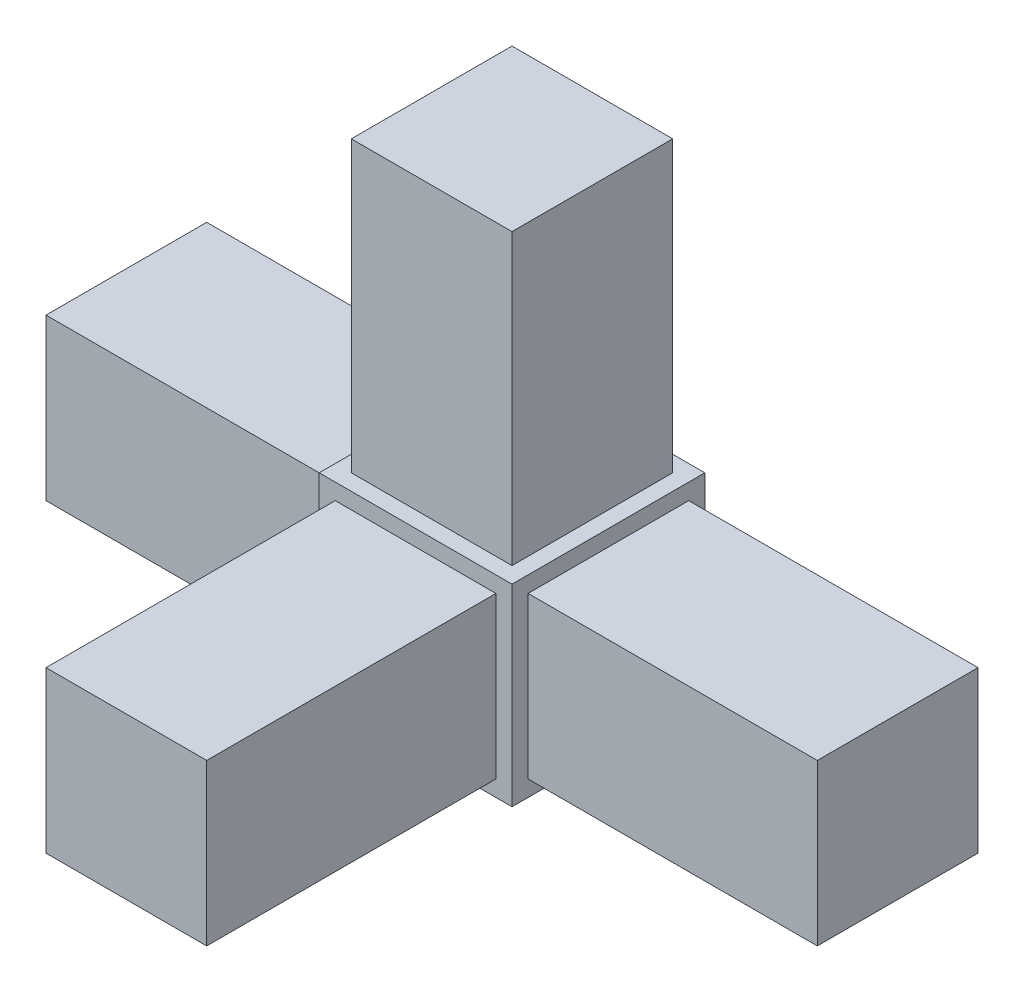
ISO-10303-21;
HEADER;
FILE_DESCRIPTION(('STEP AP214'),'2;1');
FILE_NAME('part.step','',(''),(''),'','','');
FILE_SCHEMA(('AUTOMOTIVE_DESIGN { 1 0 10303 214 1 1 1 1 }'));
ENDSEC;
DATA;
#1=APPLICATION_CONTEXT('core data for automotive mechanical design processes');
#2=APPLICATION_PROTOCOL_DEFINITION('international standard','automotive_design',2000,#1);
#3=PRODUCT_CONTEXT('',#1,'mechanical');
#4=PRODUCT('Part','Part','',(#3));
#5=PRODUCT_RELATED_PRODUCT_CATEGORY('part','',(#4));
#6=PRODUCT_DEFINITION_FORMATION('','',#4);
#7=PRODUCT_DEFINITION_CONTEXT('part definition',#1,'design');
#8=PRODUCT_DEFINITION('design','',#6,#7);
#9=PRODUCT_DEFINITION_SHAPE('','',#8);
#10=(LENGTH_UNIT() NAMED_UNIT(*) SI_UNIT(.MILLI.,.METRE.));
#11=(NAMED_UNIT(*) PLANE_ANGLE_UNIT() SI_UNIT($,.RADIAN.));
#12=(NAMED_UNIT(*) SI_UNIT($,.STERADIAN.) SOLID_ANGLE_UNIT());
#13=UNCERTAINTY_MEASURE_WITH_UNIT(LENGTH_MEASURE(1.E-05),#10,'distance_accuracy_value','');
#14=(GEOMETRIC_REPRESENTATION_CONTEXT(3) GLOBAL_UNCERTAINTY_ASSIGNED_CONTEXT((#13)) GLOBAL_UNIT_ASSIGNED_CONTEXT((#10,
#11,#12)) REPRESENTATION_CONTEXT('',''));
#15=CARTESIAN_POINT('',(0.,0.,0.));
#16=DIRECTION('',(0.,0.,1.));
#17=DIRECTION('',(1.,0.,0.));
#18=AXIS2_PLACEMENT_3D('',#15,#16,#17);
#19=CARTESIAN_POINT('',(-9.525,-9.525,19.05));
#20=DIRECTION('',(1.,0.,0.));
#21=DIRECTION('',(0.,0.,-1.));
#22=AXIS2_PLACEMENT_3D('',#19,#20,#21);
#23=PLANE('',#22);
#24=DIRECTION('',(0.,-1.,0.));
#25=VECTOR('',#24,1.);
#26=CARTESIAN_POINT('',(-9.525,-9.525,0.));
#27=LINE('',#26,#25);
#28=CARTESIAN_POINT('',(-9.525,9.525,0.));
#29=VERTEX_POINT('',#28);
#30=CARTESIAN_POINT('',(-9.525,-9.525,0.));
#31=VERTEX_POINT('',#30);
#32=EDGE_CURVE('E289',#29,#31,#27,.T.);
#33=ORIENTED_EDGE('',*,*,#32,.T.);
#34=DIRECTION('',(0.,0.,-1.));
#35=VECTOR('',#34,1.);
#36=CARTESIAN_POINT('',(-9.525,-9.525,19.05));
#37=LINE('',#36,#35);
#38=CARTESIAN_POINT('',(-9.525,-9.525,19.05));
#39=VERTEX_POINT('',#38);
#40=EDGE_CURVE('E11',#39,#31,#37,.T.);
#41=ORIENTED_EDGE('',*,*,#40,.F.);
#42=DIRECTION('',(0.,-1.,0.));
#43=VECTOR('',#42,1.);
#44=CARTESIAN_POINT('',(-9.525,-9.525,19.05));
#45=LINE('',#44,#43);
#46=CARTESIAN_POINT('',(-9.525,9.525,19.05));
#47=VERTEX_POINT('',#46);
#48=EDGE_CURVE('E290',#47,#39,#45,.T.);
#49=ORIENTED_EDGE('',*,*,#48,.F.);
#50=DIRECTION('',(0.,0.,-1.));
#51=VECTOR('',#50,1.);
#52=CARTESIAN_POINT('',(-9.525,9.525,19.05));
#53=LINE('',#52,#51);
#54=EDGE_CURVE('E300',#47,#29,#53,.T.);
#55=ORIENTED_EDGE('',*,*,#54,.T.);
#56=EDGE_LOOP('',(#33,#41,#49,#55));
#57=FACE_BOUND('',#56,.T.);
#58=DIRECTION('',(0.,-1.,0.));
#59=VECTOR('',#58,1.);
#60=CARTESIAN_POINT('',(-9.525,7.9375,1.5875));
#61=LINE('',#60,#59);
#62=CARTESIAN_POINT('',(-9.525,7.9375,1.5875));
#63=VERTEX_POINT('',#62);
#64=CARTESIAN_POINT('',(-9.525,-7.9375,1.58750000000001));
#65=VERTEX_POINT('',#64);
#66=EDGE_CURVE('E188',#63,#65,#61,.T.);
#67=ORIENTED_EDGE('',*,*,#66,.F.);
#68=DIRECTION('',(0.,0.,-1.));
#69=VECTOR('',#68,1.);
#70=CARTESIAN_POINT('',(-9.525,7.9375,1.5875));
#71=LINE('',#70,#69);
#72=CARTESIAN_POINT('',(-9.525,7.9375,17.4625));
#73=VERTEX_POINT('',#72);
#74=EDGE_CURVE('E185',#73,#63,#71,.T.);
#75=ORIENTED_EDGE('',*,*,#74,.F.);
#76=DIRECTION('',(0.,1.,0.));
#77=VECTOR('',#76,1.);
#78=CARTESIAN_POINT('',(-9.525,7.9375,17.4625));
#79=LINE('',#78,#77);
#80=CARTESIAN_POINT('',(-9.525,-7.9375,17.4625));
#81=VERTEX_POINT('',#80);
#82=EDGE_CURVE('E51',#81,#73,#79,.T.);
#83=ORIENTED_EDGE('',*,*,#82,.F.);
#84=DIRECTION('',(0.,0.,1.));
#85=VECTOR('',#84,1.);
#86=CARTESIAN_POINT('',(-9.525,-7.9375,1.58750000000001));
#87=LINE('',#86,#85);
#88=EDGE_CURVE('E46',#65,#81,#87,.T.);
#89=ORIENTED_EDGE('',*,*,#88,.F.);
#90=EDGE_LOOP('',(#67,#75,#83,#89));
#91=FACE_BOUND('',#90,.T.);
#92=ADVANCED_FACE('F32',(#57,#91),#23,.F.);
#93=CARTESIAN_POINT('',(0.,0.,19.05));
#94=DIRECTION('',(0.,0.,1.));
#95=DIRECTION('',(1.,0.,0.));
#96=AXIS2_PLACEMENT_3D('',#93,#94,#95);
#97=PLANE('',#96);
#98=ORIENTED_EDGE('',*,*,#48,.T.);
#99=DIRECTION('',(1.,0.,0.));
#100=VECTOR('',#99,1.);
#101=CARTESIAN_POINT('',(9.525,-9.525,19.05));
#102=LINE('',#101,#100);
#103=CARTESIAN_POINT('',(9.525,-9.525,19.05));
#104=VERTEX_POINT('',#103);
#105=EDGE_CURVE('E293',#39,#104,#102,.T.);
#106=ORIENTED_EDGE('',*,*,#105,.T.);
#107=DIRECTION('',(0.,1.,0.));
#108=VECTOR('',#107,1.);
#109=CARTESIAN_POINT('',(9.525,-9.525,19.05));
#110=LINE('',#109,#108);
#111=CARTESIAN_POINT('',(9.525,9.525,19.05));
#112=VERTEX_POINT('',#111);
#113=EDGE_CURVE('E296',#104,#112,#110,.T.);
#114=ORIENTED_EDGE('',*,*,#113,.T.);
#115=DIRECTION('',(-1.,0.,0.));
#116=VECTOR('',#115,1.);
#117=CARTESIAN_POINT('',(9.525,9.525,19.05));
#118=LINE('',#117,#116);
#119=EDGE_CURVE('E298',#112,#47,#118,.T.);
#120=ORIENTED_EDGE('',*,*,#119,.T.);
#121=EDGE_LOOP('',(#98,#106,#114,#120));
#122=FACE_BOUND('',#121,.T.);
#123=DIRECTION('',(1.,0.,0.));
#124=VECTOR('',#123,1.);
#125=CARTESIAN_POINT('',(7.9375,-7.9375,19.05));
#126=LINE('',#125,#124);
#127=CARTESIAN_POINT('',(-7.9375,-7.9375,19.05));
#128=VERTEX_POINT('',#127);
#129=CARTESIAN_POINT('',(7.9375,-7.9375,19.05));
#130=VERTEX_POINT('',#129);
#131=EDGE_CURVE('E192',#128,#130,#126,.T.);
#132=ORIENTED_EDGE('',*,*,#131,.F.);
#133=DIRECTION('',(0.,-1.,0.));
#134=VECTOR('',#133,1.);
#135=CARTESIAN_POINT('',(-7.9375,-7.9375,19.05));
#136=LINE('',#135,#134);
#137=CARTESIAN_POINT('',(-7.9375,7.9375,19.05));
#138=VERTEX_POINT('',#137);
#139=EDGE_CURVE('E189',#138,#128,#136,.T.);
#140=ORIENTED_EDGE('',*,*,#139,.F.);
#141=DIRECTION('',(-1.,0.,0.));
#142=VECTOR('',#141,1.);
#143=CARTESIAN_POINT('',(7.9375,7.9375,19.05));
#144=LINE('',#143,#142);
#145=CARTESIAN_POINT('',(7.9375,7.9375,19.05));
#146=VERTEX_POINT('',#145);
#147=EDGE_CURVE('E202',#146,#138,#144,.T.);
#148=ORIENTED_EDGE('',*,*,#147,.F.);
#149=DIRECTION('',(0.,1.,0.));
#150=VECTOR('',#149,1.);
#151=CARTESIAN_POINT('',(7.9375,-7.9375,19.05));
#152=LINE('',#151,#150);
#153=EDGE_CURVE('E210',#130,#146,#152,.T.);
#154=ORIENTED_EDGE('',*,*,#153,.F.);
#155=EDGE_LOOP('',(#132,#140,#148,#154));
#156=FACE_BOUND('',#155,.T.);
#157=ADVANCED_FACE('F334',(#122,#156),#97,.T.);
#158=CARTESIAN_POINT('',(9.525,-9.525,19.05));
#159=DIRECTION('',(-1.,0.,0.));
#160=DIRECTION('',(0.,0.,1.));
#161=AXIS2_PLACEMENT_3D('',#158,#159,#160);
#162=PLANE('',#161);
#163=DIRECTION('',(0.,1.,0.));
#164=VECTOR('',#163,1.);
#165=CARTESIAN_POINT('',(9.525,-9.525,0.));
#166=LINE('',#165,#164);
#167=CARTESIAN_POINT('',(9.525,-9.525,0.));
#168=VERTEX_POINT('',#167);
#169=CARTESIAN_POINT('',(9.525,9.525,0.));
#170=VERTEX_POINT('',#169);
#171=EDGE_CURVE('E305',#168,#170,#166,.T.);
#172=ORIENTED_EDGE('',*,*,#171,.T.);
#173=DIRECTION('',(0.,0.,-1.));
#174=VECTOR('',#173,1.);
#175=CARTESIAN_POINT('',(9.525,9.525,19.05));
#176=LINE('',#175,#174);
#177=EDGE_CURVE('E310',#112,#170,#176,.T.);
#178=ORIENTED_EDGE('',*,*,#177,.F.);
#179=ORIENTED_EDGE('',*,*,#113,.F.);
#180=DIRECTION('',(0.,0.,-1.));
#181=VECTOR('',#180,1.);
#182=CARTESIAN_POINT('',(9.525,-9.525,19.05));
#183=LINE('',#182,#181);
#184=EDGE_CURVE('E39',#104,#168,#183,.T.);
#185=ORIENTED_EDGE('',*,*,#184,.T.);
#186=EDGE_LOOP('',(#172,#178,#179,#185));
#187=FACE_BOUND('',#186,.T.);
#188=DIRECTION('',(0.,1.,0.));
#189=VECTOR('',#188,1.);
#190=CARTESIAN_POINT('',(9.525,-7.9375,1.5875));
#191=LINE('',#190,#189);
#192=CARTESIAN_POINT('',(9.525,-7.9375,1.5875));
#193=VERTEX_POINT('',#192);
#194=CARTESIAN_POINT('',(9.525,7.9375,1.5875));
#195=VERTEX_POINT('',#194);
#196=EDGE_CURVE('E223',#193,#195,#191,.T.);
#197=ORIENTED_EDGE('',*,*,#196,.F.);
#198=DIRECTION('',(0.,0.,-1.));
#199=VECTOR('',#198,1.);
#200=CARTESIAN_POINT('',(9.525,-7.9375,17.4625));
#201=LINE('',#200,#199);
#202=CARTESIAN_POINT('',(9.525,-7.9375,17.4625));
#203=VERTEX_POINT('',#202);
#204=EDGE_CURVE('E228',#203,#193,#201,.T.);
#205=ORIENTED_EDGE('',*,*,#204,.F.);
#206=DIRECTION('',(0.,-1.,0.));
#207=VECTOR('',#206,1.);
#208=CARTESIAN_POINT('',(9.525,-7.9375,17.4625));
#209=LINE('',#208,#207);
#210=CARTESIAN_POINT('',(9.525,7.9375,17.4625));
#211=VERTEX_POINT('',#210);
#212=EDGE_CURVE('E240',#211,#203,#209,.T.);
#213=ORIENTED_EDGE('',*,*,#212,.F.);
#214=DIRECTION('',(0.,0.,1.));
#215=VECTOR('',#214,1.);
#216=CARTESIAN_POINT('',(9.525,7.9375,17.4625));
#217=LINE('',#216,#215);
#218=EDGE_CURVE('E237',#195,#211,#217,.T.);
#219=ORIENTED_EDGE('',*,*,#218,.F.);
#220=EDGE_LOOP('',(#197,#205,#213,#219));
#221=FACE_BOUND('',#220,.T.);
#222=ADVANCED_FACE('F317',(#187,#221),#162,.F.);
#223=CARTESIAN_POINT('',(9.525,9.525,19.05));
#224=DIRECTION('',(0.,-1.,0.));
#225=DIRECTION('',(1.,0.,0.));
#226=AXIS2_PLACEMENT_3D('',#223,#224,#225);
#227=PLANE('',#226);
#228=DIRECTION('',(-1.,0.,0.));
#229=VECTOR('',#228,1.);
#230=CARTESIAN_POINT('',(9.525,9.525,0.));
#231=LINE('',#230,#229);
#232=EDGE_CURVE('E294',#170,#29,#231,.T.);
#233=ORIENTED_EDGE('',*,*,#232,.T.);
#234=ORIENTED_EDGE('',*,*,#54,.F.);
#235=ORIENTED_EDGE('',*,*,#119,.F.);
#236=ORIENTED_EDGE('',*,*,#177,.T.);
#237=EDGE_LOOP('',(#233,#234,#235,#236));
#238=FACE_BOUND('',#237,.T.);
#239=DIRECTION('',(0.,0.,-1.));
#240=VECTOR('',#239,1.);
#241=CARTESIAN_POINT('',(7.9375,9.525,1.5875));
#242=LINE('',#241,#240);
#243=CARTESIAN_POINT('',(7.9375,9.525,17.4625));
#244=VERTEX_POINT('',#243);
#245=CARTESIAN_POINT('',(7.9375,9.525,1.5875));
#246=VERTEX_POINT('',#245);
#247=EDGE_CURVE('E256',#244,#246,#242,.T.);
#248=ORIENTED_EDGE('',*,*,#247,.F.);
#249=DIRECTION('',(1.,0.,0.));
#250=VECTOR('',#249,1.);
#251=CARTESIAN_POINT('',(-7.9375,9.525,17.4625));
#252=LINE('',#251,#250);
#253=CARTESIAN_POINT('',(-7.9375,9.525,17.4625));
#254=VERTEX_POINT('',#253);
#255=EDGE_CURVE('E261',#254,#244,#252,.T.);
#256=ORIENTED_EDGE('',*,*,#255,.F.);
#257=DIRECTION('',(0.,0.,1.));
#258=VECTOR('',#257,1.);
#259=CARTESIAN_POINT('',(-7.9375,9.525,1.5875));
#260=LINE('',#259,#258);
#261=CARTESIAN_POINT('',(-7.9375,9.525,1.58750000000001));
#262=VERTEX_POINT('',#261);
#263=EDGE_CURVE('E273',#262,#254,#260,.T.);
#264=ORIENTED_EDGE('',*,*,#263,.F.);
#265=DIRECTION('',(-1.,0.,0.));
#266=VECTOR('',#265,1.);
#267=CARTESIAN_POINT('',(-7.9375,9.525,1.5875));
#268=LINE('',#267,#266);
#269=EDGE_CURVE('E270',#246,#262,#268,.T.);
#270=ORIENTED_EDGE('',*,*,#269,.F.);
#271=EDGE_LOOP('',(#248,#256,#264,#270));
#272=FACE_BOUND('',#271,.T.);
#273=ADVANCED_FACE('F327',(#238,#272),#227,.F.);
#274=CARTESIAN_POINT('',(9.525,-9.525,19.05));
#275=DIRECTION('',(0.,1.,0.));
#276=DIRECTION('',(-1.,0.,0.));
#277=AXIS2_PLACEMENT_3D('',#274,#275,#276);
#278=PLANE('',#277);
#279=DIRECTION('',(1.,0.,0.));
#280=VECTOR('',#279,1.);
#281=CARTESIAN_POINT('',(9.525,-9.525,0.));
#282=LINE('',#281,#280);
#283=EDGE_CURVE('E303',#31,#168,#282,.T.);
#284=ORIENTED_EDGE('',*,*,#283,.T.);
#285=ORIENTED_EDGE('',*,*,#184,.F.);
#286=ORIENTED_EDGE('',*,*,#105,.F.);
#287=ORIENTED_EDGE('',*,*,#40,.T.);
#288=EDGE_LOOP('',(#284,#285,#286,#287));
#289=FACE_BOUND('',#288,.T.);
#290=ADVANCED_FACE('F336',(#289),#278,.F.);
#291=CARTESIAN_POINT('',(0.,0.,0.));
#292=DIRECTION('',(0.,0.,1.));
#293=DIRECTION('',(1.,0.,0.));
#294=AXIS2_PLACEMENT_3D('',#291,#292,#293);
#295=PLANE('',#294);
#296=ORIENTED_EDGE('',*,*,#32,.F.);
#297=ORIENTED_EDGE('',*,*,#232,.F.);
#298=ORIENTED_EDGE('',*,*,#171,.F.);
#299=ORIENTED_EDGE('',*,*,#283,.F.);
#300=EDGE_LOOP('',(#296,#297,#298,#299));
#301=FACE_BOUND('',#300,.T.);
#302=ADVANCED_FACE('F324',(#301),#295,.F.);
#303=CARTESIAN_POINT('',(7.9375,38.1,1.5875));
#304=DIRECTION('',(-1.,0.,0.));
#305=DIRECTION('',(0.,0.,1.));
#306=AXIS2_PLACEMENT_3D('',#303,#304,#305);
#307=PLANE('',#306);
#308=ORIENTED_EDGE('',*,*,#247,.T.);
#309=DIRECTION('',(0.,-1.,0.));
#310=VECTOR('',#309,1.);
#311=CARTESIAN_POINT('',(7.9375,38.1,1.5875));
#312=LINE('',#311,#310);
#313=CARTESIAN_POINT('',(7.9375,38.1,1.5875));
#314=VERTEX_POINT('',#313);
#315=EDGE_CURVE('E286',#314,#246,#312,.T.);
#316=ORIENTED_EDGE('',*,*,#315,.F.);
#317=DIRECTION('',(0.,0.,-1.));
#318=VECTOR('',#317,1.);
#319=CARTESIAN_POINT('',(7.9375,38.1,1.5875));
#320=LINE('',#319,#318);
#321=CARTESIAN_POINT('',(7.9375,38.1,17.4625));
#322=VERTEX_POINT('',#321);
#323=EDGE_CURVE('E257',#322,#314,#320,.T.);
#324=ORIENTED_EDGE('',*,*,#323,.F.);
#325=DIRECTION('',(0.,-1.,0.));
#326=VECTOR('',#325,1.);
#327=CARTESIAN_POINT('',(7.9375,38.1,17.4625));
#328=LINE('',#327,#326);
#329=EDGE_CURVE('E267',#322,#244,#328,.T.);
#330=ORIENTED_EDGE('',*,*,#329,.T.);
#331=EDGE_LOOP('',(#308,#316,#324,#330));
#332=FACE_BOUND('',#331,.T.);
#333=ADVANCED_FACE('F342',(#332),#307,.F.);
#334=CARTESIAN_POINT('',(-7.9375,38.1,1.5875));
#335=DIRECTION('',(0.,0.,1.));
#336=DIRECTION('',(1.,0.,0.));
#337=AXIS2_PLACEMENT_3D('',#334,#335,#336);
#338=PLANE('',#337);
#339=ORIENTED_EDGE('',*,*,#269,.T.);
#340=DIRECTION('',(0.,-1.,0.));
#341=VECTOR('',#340,1.);
#342=CARTESIAN_POINT('',(-7.9375,38.1,1.5875));
#343=LINE('',#342,#341);
#344=CARTESIAN_POINT('',(-7.9375,38.1,1.5875));
#345=VERTEX_POINT('',#344);
#346=EDGE_CURVE('E283',#345,#262,#343,.T.);
#347=ORIENTED_EDGE('',*,*,#346,.F.);
#348=DIRECTION('',(-1.,0.,0.));
#349=VECTOR('',#348,1.);
#350=CARTESIAN_POINT('',(-7.9375,38.1,1.5875));
#351=LINE('',#350,#349);
#352=EDGE_CURVE('E260',#314,#345,#351,.T.);
#353=ORIENTED_EDGE('',*,*,#352,.F.);
#354=ORIENTED_EDGE('',*,*,#315,.T.);
#355=EDGE_LOOP('',(#339,#347,#353,#354));
#356=FACE_BOUND('',#355,.T.);
#357=ADVANCED_FACE('F357',(#356),#338,.F.);
#358=CARTESIAN_POINT('',(-7.9375,38.1,1.5875));
#359=DIRECTION('',(1.,0.,0.));
#360=DIRECTION('',(0.,0.,-1.));
#361=AXIS2_PLACEMENT_3D('',#358,#359,#360);
#362=PLANE('',#361);
#363=ORIENTED_EDGE('',*,*,#263,.T.);
#364=DIRECTION('',(0.,-1.,0.));
#365=VECTOR('',#364,1.);
#366=CARTESIAN_POINT('',(-7.9375,38.1,17.4625));
#367=LINE('',#366,#365);
#368=CARTESIAN_POINT('',(-7.9375,38.1,17.4625));
#369=VERTEX_POINT('',#368);
#370=EDGE_CURVE('E280',#369,#254,#367,.T.);
#371=ORIENTED_EDGE('',*,*,#370,.F.);
#372=DIRECTION('',(0.,0.,1.));
#373=VECTOR('',#372,1.);
#374=CARTESIAN_POINT('',(-7.9375,38.1,1.5875));
#375=LINE('',#374,#373);
#376=EDGE_CURVE('E263',#345,#369,#375,.T.);
#377=ORIENTED_EDGE('',*,*,#376,.F.);
#378=ORIENTED_EDGE('',*,*,#346,.T.);
#379=EDGE_LOOP('',(#363,#371,#377,#378));
#380=FACE_BOUND('',#379,.T.);
#381=ADVANCED_FACE('F361',(#380),#362,.F.);
#382=CARTESIAN_POINT('',(-7.9375,38.1,17.4625));
#383=DIRECTION('',(0.,0.,-1.));
#384=DIRECTION('',(-1.,0.,0.));
#385=AXIS2_PLACEMENT_3D('',#382,#383,#384);
#386=PLANE('',#385);
#387=ORIENTED_EDGE('',*,*,#255,.T.);
#388=ORIENTED_EDGE('',*,*,#329,.F.);
#389=DIRECTION('',(1.,0.,0.));
#390=VECTOR('',#389,1.);
#391=CARTESIAN_POINT('',(-7.9375,38.1,17.4625));
#392=LINE('',#391,#390);
#393=EDGE_CURVE('E265',#369,#322,#392,.T.);
#394=ORIENTED_EDGE('',*,*,#393,.F.);
#395=ORIENTED_EDGE('',*,*,#370,.T.);
#396=EDGE_LOOP('',(#387,#388,#394,#395));
#397=FACE_BOUND('',#396,.T.);
#398=ADVANCED_FACE('F365',(#397),#386,.F.);
#399=CARTESIAN_POINT('',(0.,38.1,0.));
#400=DIRECTION('',(0.,1.,0.));
#401=DIRECTION('',(0.,0.,1.));
#402=AXIS2_PLACEMENT_3D('',#399,#400,#401);
#403=PLANE('',#402);
#404=ORIENTED_EDGE('',*,*,#323,.T.);
#405=ORIENTED_EDGE('',*,*,#352,.T.);
#406=ORIENTED_EDGE('',*,*,#376,.T.);
#407=ORIENTED_EDGE('',*,*,#393,.T.);
#408=EDGE_LOOP('',(#404,#405,#406,#407));
#409=FACE_BOUND('',#408,.T.);
#410=ADVANCED_FACE('F369',(#409),#403,.T.);
#411=CARTESIAN_POINT('',(38.1,-7.9375,1.5875));
#412=DIRECTION('',(0.,0.,1.));
#413=DIRECTION('',(1.,0.,0.));
#414=AXIS2_PLACEMENT_3D('',#411,#412,#413);
#415=PLANE('',#414);
#416=ORIENTED_EDGE('',*,*,#196,.T.);
#417=DIRECTION('',(-1.,0.,0.));
#418=VECTOR('',#417,1.);
#419=CARTESIAN_POINT('',(38.1,7.9375,1.5875));
#420=LINE('',#419,#418);
#421=CARTESIAN_POINT('',(38.1,7.9375,1.5875));
#422=VERTEX_POINT('',#421);
#423=EDGE_CURVE('E253',#422,#195,#420,.T.);
#424=ORIENTED_EDGE('',*,*,#423,.F.);
#425=DIRECTION('',(0.,1.,0.));
#426=VECTOR('',#425,1.);
#427=CARTESIAN_POINT('',(38.1,-7.9375,1.5875));
#428=LINE('',#427,#426);
#429=CARTESIAN_POINT('',(38.1,-7.9375,1.5875));
#430=VERTEX_POINT('',#429);
#431=EDGE_CURVE('E224',#430,#422,#428,.T.);
#432=ORIENTED_EDGE('',*,*,#431,.F.);
#433=DIRECTION('',(-1.,0.,0.));
#434=VECTOR('',#433,1.);
#435=CARTESIAN_POINT('',(38.1,-7.9375,1.5875));
#436=LINE('',#435,#434);
#437=EDGE_CURVE('E234',#430,#193,#436,.T.);
#438=ORIENTED_EDGE('',*,*,#437,.T.);
#439=EDGE_LOOP('',(#416,#424,#432,#438));
#440=FACE_BOUND('',#439,.T.);
#441=ADVANCED_FACE('F373',(#440),#415,.F.);
#442=CARTESIAN_POINT('',(38.1,7.9375,17.4625));
#443=DIRECTION('',(0.,-1.,0.));
#444=DIRECTION('',(0.,0.,-1.));
#445=AXIS2_PLACEMENT_3D('',#442,#443,#444);
#446=PLANE('',#445);
#447=ORIENTED_EDGE('',*,*,#218,.T.);
#448=DIRECTION('',(-1.,0.,0.));
#449=VECTOR('',#448,1.);
#450=CARTESIAN_POINT('',(38.1,7.9375,17.4625));
#451=LINE('',#450,#449);
#452=CARTESIAN_POINT('',(38.1,7.9375,17.4625));
#453=VERTEX_POINT('',#452);
#454=EDGE_CURVE('E250',#453,#211,#451,.T.);
#455=ORIENTED_EDGE('',*,*,#454,.F.);
#456=DIRECTION('',(0.,0.,1.));
#457=VECTOR('',#456,1.);
#458=CARTESIAN_POINT('',(38.1,7.9375,17.4625));
#459=LINE('',#458,#457);
#460=EDGE_CURVE('E227',#422,#453,#459,.T.);
#461=ORIENTED_EDGE('',*,*,#460,.F.);
#462=ORIENTED_EDGE('',*,*,#423,.T.);
#463=EDGE_LOOP('',(#447,#455,#461,#462));
#464=FACE_BOUND('',#463,.T.);
#465=ADVANCED_FACE('F377',(#464),#446,.F.);
#466=CARTESIAN_POINT('',(38.1,-7.9375,17.4625));
#467=DIRECTION('',(0.,0.,-1.));
#468=DIRECTION('',(-1.,0.,0.));
#469=AXIS2_PLACEMENT_3D('',#466,#467,#468);
#470=PLANE('',#469);
#471=ORIENTED_EDGE('',*,*,#212,.T.);
#472=DIRECTION('',(-1.,0.,0.));
#473=VECTOR('',#472,1.);
#474=CARTESIAN_POINT('',(38.1,-7.9375,17.4625));
#475=LINE('',#474,#473);
#476=CARTESIAN_POINT('',(38.1,-7.9375,17.4625));
#477=VERTEX_POINT('',#476);
#478=EDGE_CURVE('E247',#477,#203,#475,.T.);
#479=ORIENTED_EDGE('',*,*,#478,.F.);
#480=DIRECTION('',(0.,-1.,0.));
#481=VECTOR('',#480,1.);
#482=CARTESIAN_POINT('',(38.1,-7.9375,17.4625));
#483=LINE('',#482,#481);
#484=EDGE_CURVE('E230',#453,#477,#483,.T.);
#485=ORIENTED_EDGE('',*,*,#484,.F.);
#486=ORIENTED_EDGE('',*,*,#454,.T.);
#487=EDGE_LOOP('',(#471,#479,#485,#486));
#488=FACE_BOUND('',#487,.T.);
#489=ADVANCED_FACE('F381',(#488),#470,.F.);
#490=CARTESIAN_POINT('',(38.1,-7.9375,17.4625));
#491=DIRECTION('',(0.,1.,0.));
#492=DIRECTION('',(0.,0.,1.));
#493=AXIS2_PLACEMENT_3D('',#490,#491,#492);
#494=PLANE('',#493);
#495=ORIENTED_EDGE('',*,*,#204,.T.);
#496=ORIENTED_EDGE('',*,*,#437,.F.);
#497=DIRECTION('',(0.,0.,-1.));
#498=VECTOR('',#497,1.);
#499=CARTESIAN_POINT('',(38.1,-7.9375,17.4625));
#500=LINE('',#499,#498);
#501=EDGE_CURVE('E232',#477,#430,#500,.T.);
#502=ORIENTED_EDGE('',*,*,#501,.F.);
#503=ORIENTED_EDGE('',*,*,#478,.T.);
#504=EDGE_LOOP('',(#495,#496,#502,#503));
#505=FACE_BOUND('',#504,.T.);
#506=ADVANCED_FACE('F385',(#505),#494,.F.);
#507=CARTESIAN_POINT('',(38.1,0.,0.));
#508=DIRECTION('',(-1.,0.,0.));
#509=DIRECTION('',(0.,0.,1.));
#510=AXIS2_PLACEMENT_3D('',#507,#508,#509);
#511=PLANE('',#510);
#512=ORIENTED_EDGE('',*,*,#431,.T.);
#513=ORIENTED_EDGE('',*,*,#460,.T.);
#514=ORIENTED_EDGE('',*,*,#484,.T.);
#515=ORIENTED_EDGE('',*,*,#501,.T.);
#516=EDGE_LOOP('',(#512,#513,#514,#515));
#517=FACE_BOUND('',#516,.T.);
#518=ADVANCED_FACE('F389',(#517),#511,.F.);
#519=CARTESIAN_POINT('',(-7.9375,-7.9375,47.625));
#520=DIRECTION('',(1.,0.,0.));
#521=DIRECTION('',(0.,0.,-1.));
#522=AXIS2_PLACEMENT_3D('',#519,#520,#521);
#523=PLANE('',#522);
#524=ORIENTED_EDGE('',*,*,#139,.T.);
#525=DIRECTION('',(0.,0.,-1.));
#526=VECTOR('',#525,1.);
#527=CARTESIAN_POINT('',(-7.9375,-7.9375,47.625));
#528=LINE('',#527,#526);
#529=CARTESIAN_POINT('',(-7.9375,-7.9375,47.625));
#530=VERTEX_POINT('',#529);
#531=EDGE_CURVE('E221',#530,#128,#528,.T.);
#532=ORIENTED_EDGE('',*,*,#531,.F.);
#533=DIRECTION('',(0.,-1.,0.));
#534=VECTOR('',#533,1.);
#535=CARTESIAN_POINT('',(-7.9375,-7.9375,47.625));
#536=LINE('',#535,#534);
#537=CARTESIAN_POINT('',(-7.9375,7.9375,47.625));
#538=VERTEX_POINT('',#537);
#539=EDGE_CURVE('E198',#538,#530,#536,.T.);
#540=ORIENTED_EDGE('',*,*,#539,.F.);
#541=DIRECTION('',(0.,0.,-1.));
#542=VECTOR('',#541,1.);
#543=CARTESIAN_POINT('',(-7.9375,7.9375,47.625));
#544=LINE('',#543,#542);
#545=EDGE_CURVE('E207',#538,#138,#544,.T.);
#546=ORIENTED_EDGE('',*,*,#545,.T.);
#547=EDGE_LOOP('',(#524,#532,#540,#546));
#548=FACE_BOUND('',#547,.T.);
#549=ADVANCED_FACE('F393',(#548),#523,.F.);
#550=CARTESIAN_POINT('',(7.9375,-7.9375,47.625));
#551=DIRECTION('',(0.,1.,0.));
#552=DIRECTION('',(-1.,0.,0.));
#553=AXIS2_PLACEMENT_3D('',#550,#551,#552);
#554=PLANE('',#553);
#555=ORIENTED_EDGE('',*,*,#131,.T.);
#556=DIRECTION('',(0.,0.,-1.));
#557=VECTOR('',#556,1.);
#558=CARTESIAN_POINT('',(7.9375,-7.9375,47.625));
#559=LINE('',#558,#557);
#560=CARTESIAN_POINT('',(7.9375,-7.9375,47.625));
#561=VERTEX_POINT('',#560);
#562=EDGE_CURVE('E218',#561,#130,#559,.T.);
#563=ORIENTED_EDGE('',*,*,#562,.F.);
#564=DIRECTION('',(1.,0.,0.));
#565=VECTOR('',#564,1.);
#566=CARTESIAN_POINT('',(7.9375,-7.9375,47.625));
#567=LINE('',#566,#565);
#568=EDGE_CURVE('E201',#530,#561,#567,.T.);
#569=ORIENTED_EDGE('',*,*,#568,.F.);
#570=ORIENTED_EDGE('',*,*,#531,.T.);
#571=EDGE_LOOP('',(#555,#563,#569,#570));
#572=FACE_BOUND('',#571,.T.);
#573=ADVANCED_FACE('F397',(#572),#554,.F.);
#574=CARTESIAN_POINT('',(7.9375,-7.9375,47.625));
#575=DIRECTION('',(-1.,0.,0.));
#576=DIRECTION('',(0.,0.,1.));
#577=AXIS2_PLACEMENT_3D('',#574,#575,#576);
#578=PLANE('',#577);
#579=ORIENTED_EDGE('',*,*,#153,.T.);
#580=DIRECTION('',(0.,0.,-1.));
#581=VECTOR('',#580,1.);
#582=CARTESIAN_POINT('',(7.9375,7.9375,47.625));
#583=LINE('',#582,#581);
#584=CARTESIAN_POINT('',(7.9375,7.9375,47.625));
#585=VERTEX_POINT('',#584);
#586=EDGE_CURVE('E216',#585,#146,#583,.T.);
#587=ORIENTED_EDGE('',*,*,#586,.F.);
#588=DIRECTION('',(0.,1.,0.));
#589=VECTOR('',#588,1.);
#590=CARTESIAN_POINT('',(7.9375,-7.9375,47.625));
#591=LINE('',#590,#589);
#592=EDGE_CURVE('E204',#561,#585,#591,.T.);
#593=ORIENTED_EDGE('',*,*,#592,.F.);
#594=ORIENTED_EDGE('',*,*,#562,.T.);
#595=EDGE_LOOP('',(#579,#587,#593,#594));
#596=FACE_BOUND('',#595,.T.);
#597=ADVANCED_FACE('F401',(#596),#578,.F.);
#598=CARTESIAN_POINT('',(7.9375,7.9375,47.625));
#599=DIRECTION('',(0.,-1.,0.));
#600=DIRECTION('',(0.,0.,-1.));
#601=AXIS2_PLACEMENT_3D('',#598,#599,#600);
#602=PLANE('',#601);
#603=ORIENTED_EDGE('',*,*,#147,.T.);
#604=ORIENTED_EDGE('',*,*,#545,.F.);
#605=DIRECTION('',(-1.,0.,0.));
#606=VECTOR('',#605,1.);
#607=CARTESIAN_POINT('',(7.9375,7.9375,47.625));
#608=LINE('',#607,#606);
#609=EDGE_CURVE('E206',#585,#538,#608,.T.);
#610=ORIENTED_EDGE('',*,*,#609,.F.);
#611=ORIENTED_EDGE('',*,*,#586,.T.);
#612=EDGE_LOOP('',(#603,#604,#610,#611));
#613=FACE_BOUND('',#612,.T.);
#614=ADVANCED_FACE('F405',(#613),#602,.F.);
#615=CARTESIAN_POINT('',(0.,0.,47.625));
#616=DIRECTION('',(0.,0.,1.));
#617=DIRECTION('',(1.,0.,0.));
#618=AXIS2_PLACEMENT_3D('',#615,#616,#617);
#619=PLANE('',#618);
#620=ORIENTED_EDGE('',*,*,#539,.T.);
#621=ORIENTED_EDGE('',*,*,#568,.T.);
#622=ORIENTED_EDGE('',*,*,#592,.T.);
#623=ORIENTED_EDGE('',*,*,#609,.T.);
#624=EDGE_LOOP('',(#620,#621,#622,#623));
#625=FACE_BOUND('',#624,.T.);
#626=ADVANCED_FACE('F409',(#625),#619,.T.);
#627=CARTESIAN_POINT('',(-38.1,7.9375,1.5875));
#628=DIRECTION('',(0.,0.,1.));
#629=DIRECTION('',(0.,-1.,0.));
#630=AXIS2_PLACEMENT_3D('',#627,#628,#629);
#631=PLANE('',#630);
#632=ORIENTED_EDGE('',*,*,#66,.T.);
#633=DIRECTION('',(1.,0.,0.));
#634=VECTOR('',#633,1.);
#635=CARTESIAN_POINT('',(-38.1,-7.9375,1.58750000000001));
#636=LINE('',#635,#634);
#637=CARTESIAN_POINT('',(-38.1,-7.9375,1.58750000000001));
#638=VERTEX_POINT('',#637);
#639=EDGE_CURVE('E169',#638,#65,#636,.T.);
#640=ORIENTED_EDGE('',*,*,#639,.F.);
#641=DIRECTION('',(0.,-1.,0.));
#642=VECTOR('',#641,1.);
#643=CARTESIAN_POINT('',(-38.1,7.9375,1.5875));
#644=LINE('',#643,#642);
#645=CARTESIAN_POINT('',(-38.1,7.9375,1.5875));
#646=VERTEX_POINT('',#645);
#647=EDGE_CURVE('E176',#646,#638,#644,.T.);
#648=ORIENTED_EDGE('',*,*,#647,.F.);
#649=DIRECTION('',(1.,0.,0.));
#650=VECTOR('',#649,1.);
#651=CARTESIAN_POINT('',(-38.1,7.9375,1.5875));
#652=LINE('',#651,#650);
#653=EDGE_CURVE('E579',#646,#63,#652,.T.);
#654=ORIENTED_EDGE('',*,*,#653,.T.);
#655=EDGE_LOOP('',(#632,#640,#648,#654));
#656=FACE_BOUND('',#655,.T.);
#657=ADVANCED_FACE('F187',(#656),#631,.F.);
#658=CARTESIAN_POINT('',(-38.1,-7.9375,1.58750000000001));
#659=DIRECTION('',(0.,1.,0.));
#660=DIRECTION('',(0.,0.,1.));
#661=AXIS2_PLACEMENT_3D('',#658,#659,#660);
#662=PLANE('',#661);
#663=ORIENTED_EDGE('',*,*,#88,.T.);
#664=DIRECTION('',(1.,0.,0.));
#665=VECTOR('',#664,1.);
#666=CARTESIAN_POINT('',(-38.1,-7.9375,17.4625));
#667=LINE('',#666,#665);
#668=CARTESIAN_POINT('',(-38.1,-7.9375,17.4625));
#669=VERTEX_POINT('',#668);
#670=EDGE_CURVE('E172',#669,#81,#667,.T.);
#671=ORIENTED_EDGE('',*,*,#670,.F.);
#672=DIRECTION('',(0.,0.,1.));
#673=VECTOR('',#672,1.);
#674=CARTESIAN_POINT('',(-38.1,-7.9375,1.58750000000001));
#675=LINE('',#674,#673);
#676=EDGE_CURVE('E165',#638,#669,#675,.T.);
#677=ORIENTED_EDGE('',*,*,#676,.F.);
#678=ORIENTED_EDGE('',*,*,#639,.T.);
#679=EDGE_LOOP('',(#663,#671,#677,#678));
#680=FACE_BOUND('',#679,.T.);
#681=ADVANCED_FACE('F167',(#680),#662,.F.);
#682=CARTESIAN_POINT('',(-38.1,7.9375,17.4625));
#683=DIRECTION('',(0.,0.,-1.));
#684=DIRECTION('',(0.,1.,0.));
#685=AXIS2_PLACEMENT_3D('',#682,#683,#684);
#686=PLANE('',#685);
#687=ORIENTED_EDGE('',*,*,#82,.T.);
#688=DIRECTION('',(1.,0.,0.));
#689=VECTOR('',#688,1.);
#690=CARTESIAN_POINT('',(-38.1,7.9375,17.4625));
#691=LINE('',#690,#689);
#692=CARTESIAN_POINT('',(-38.1,7.9375,17.4625));
#693=VERTEX_POINT('',#692);
#694=EDGE_CURVE('E194',#693,#73,#691,.T.);
#695=ORIENTED_EDGE('',*,*,#694,.F.);
#696=DIRECTION('',(0.,1.,0.));
#697=VECTOR('',#696,1.);
#698=CARTESIAN_POINT('',(-38.1,7.9375,17.4625));
#699=LINE('',#698,#697);
#700=EDGE_CURVE('E175',#669,#693,#699,.T.);
#701=ORIENTED_EDGE('',*,*,#700,.F.);
#702=ORIENTED_EDGE('',*,*,#670,.T.);
#703=EDGE_LOOP('',(#687,#695,#701,#702));
#704=FACE_BOUND('',#703,.T.);
#705=ADVANCED_FACE('F418',(#704),#686,.F.);
#706=CARTESIAN_POINT('',(-38.1,7.9375,1.5875));
#707=DIRECTION('',(0.,-1.,0.));
#708=DIRECTION('',(0.,0.,-1.));
#709=AXIS2_PLACEMENT_3D('',#706,#707,#708);
#710=PLANE('',#709);
#711=ORIENTED_EDGE('',*,*,#74,.T.);
#712=ORIENTED_EDGE('',*,*,#653,.F.);
#713=DIRECTION('',(0.,0.,-1.));
#714=VECTOR('',#713,1.);
#715=CARTESIAN_POINT('',(-38.1,7.9375,1.5875));
#716=LINE('',#715,#714);
#717=EDGE_CURVE('E181',#693,#646,#716,.T.);
#718=ORIENTED_EDGE('',*,*,#717,.F.);
#719=ORIENTED_EDGE('',*,*,#694,.T.);
#720=EDGE_LOOP('',(#711,#712,#718,#719));
#721=FACE_BOUND('',#720,.T.);
#722=ADVANCED_FACE('F421',(#721),#710,.F.);
#723=CARTESIAN_POINT('',(-38.1,0.,0.));
#724=DIRECTION('',(-1.,0.,0.));
#725=DIRECTION('',(0.,0.,1.));
#726=AXIS2_PLACEMENT_3D('',#723,#724,#725);
#727=PLANE('',#726);
#728=ORIENTED_EDGE('',*,*,#647,.T.);
#729=ORIENTED_EDGE('',*,*,#676,.T.);
#730=ORIENTED_EDGE('',*,*,#700,.T.);
#731=ORIENTED_EDGE('',*,*,#717,.T.);
#732=EDGE_LOOP('',(#728,#729,#730,#731));
#733=FACE_BOUND('',#732,.T.);
#734=ADVANCED_FACE('F179',(#733),#727,.T.);
#735=CLOSED_SHELL('',(#92,#157,#222,#273,#290,#302,#333,#357,#381,#398,#410,#441,#465,#489,#506,
#518,#549,#573,#597,#614,#626,#657,#681,#705,#722,#734));
#736=MANIFOLD_SOLID_BREP('B2',#735);
#737=ADVANCED_BREP_SHAPE_REPRESENTATION('',(#18,#736),#14);
#738=SHAPE_DEFINITION_REPRESENTATION(#9,#737);
ENDSEC;
END-ISO-10303-21;
